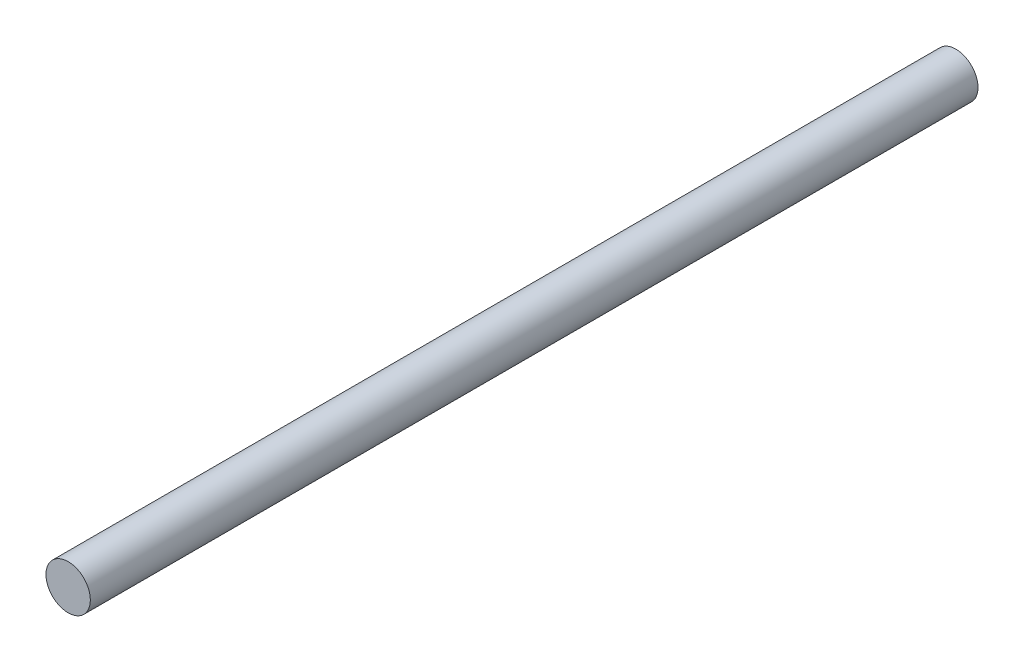
ISO-10303-21;
HEADER;
FILE_DESCRIPTION(('STEP AP214'),'2;1');
FILE_NAME('part.step','',(''),(''),'','','');
FILE_SCHEMA(('AUTOMOTIVE_DESIGN { 1 0 10303 214 1 1 1 1 }'));
ENDSEC;
DATA;
#1=APPLICATION_CONTEXT('core data for automotive mechanical design processes');
#2=APPLICATION_PROTOCOL_DEFINITION('international standard','automotive_design',2000,#1);
#3=PRODUCT_CONTEXT('',#1,'mechanical');
#4=PRODUCT('Part','Part','',(#3));
#5=PRODUCT_RELATED_PRODUCT_CATEGORY('part','',(#4));
#6=PRODUCT_DEFINITION_FORMATION('','',#4);
#7=PRODUCT_DEFINITION_CONTEXT('part definition',#1,'design');
#8=PRODUCT_DEFINITION('design','',#6,#7);
#9=PRODUCT_DEFINITION_SHAPE('','',#8);
#10=(LENGTH_UNIT() NAMED_UNIT(*) SI_UNIT(.MILLI.,.METRE.));
#11=(NAMED_UNIT(*) PLANE_ANGLE_UNIT() SI_UNIT($,.RADIAN.));
#12=(NAMED_UNIT(*) SI_UNIT($,.STERADIAN.) SOLID_ANGLE_UNIT());
#13=UNCERTAINTY_MEASURE_WITH_UNIT(LENGTH_MEASURE(1.E-05),#10,'distance_accuracy_value','');
#14=(GEOMETRIC_REPRESENTATION_CONTEXT(3) GLOBAL_UNCERTAINTY_ASSIGNED_CONTEXT((#13)) GLOBAL_UNIT_ASSIGNED_CONTEXT((#10,
#11,#12)) REPRESENTATION_CONTEXT('',''));
#15=CARTESIAN_POINT('',(0.,0.,0.));
#16=DIRECTION('',(0.,0.,1.));
#17=DIRECTION('',(1.,0.,0.));
#18=AXIS2_PLACEMENT_3D('',#15,#16,#17);
#19=CARTESIAN_POINT('',(0.,0.,100.));
#20=DIRECTION('',(0.,0.,-1.));
#21=DIRECTION('',(-1.,0.,0.));
#22=AXIS2_PLACEMENT_3D('',#19,#20,#21);
#23=CYLINDRICAL_SURFACE('',#22,2.5);
#24=CARTESIAN_POINT('',(0.,-2.5,99.5));
#25=CARTESIAN_POINT('',(0.0277884533963166,-2.49999948790436,99.4999989777508));
#26=CARTESIAN_POINT('',(0.0555898301007615,-2.49953192589115,99.4976755785162));
#27=CARTESIAN_POINT('',(0.11040675384451,-2.49771182811616,99.4884507499424));
#28=CARTESIAN_POINT('',(0.137421658770679,-2.49635858930093,99.4815456835993));
#29=CARTESIAN_POINT('',(0.189865152631659,-2.49291824639143,99.4633793631896));
#30=CARTESIAN_POINT('',(0.215295233966571,-2.49083184538359,99.4521222815777));
#31=CARTESIAN_POINT('',(0.263903994432117,-2.48615199017657,99.4255838762443));
#32=CARTESIAN_POINT('',(0.287082807537908,-2.48355856617853,99.4103027921964));
#33=CARTESIAN_POINT('',(0.330846738657434,-2.47811082664985,99.3759307528543));
#34=CARTESIAN_POINT('',(0.351396975579264,-2.47525372752174,99.3567958223044));
#35=CARTESIAN_POINT('',(0.389018378304016,-2.46962090226294,99.3153537918041));
#36=CARTESIAN_POINT('',(0.406089272385215,-2.46684518250212,99.2930464443324));
#37=CARTESIAN_POINT('',(0.436415876673812,-2.46166220906308,99.2456419034941));
#38=CARTESIAN_POINT('',(0.449635469432935,-2.45925853682473,99.2205211781018));
#39=CARTESIAN_POINT('',(0.471652833290155,-2.45513134029209,99.168359090498));
#40=CARTESIAN_POINT('',(0.480451041218621,-2.45340774880981,99.1413179183268));
#41=CARTESIAN_POINT('',(0.493262649942415,-2.45086402626102,99.0864578180461));
#42=CARTESIAN_POINT('',(0.497337248979388,-2.45003235053594,99.0586537279289));
#43=CARTESIAN_POINT('',(0.500776063863059,-2.44933187530314,99.0027450893178));
#44=CARTESIAN_POINT('',(0.50014076135675,-2.4494629773392,98.9746405718399));
#45=CARTESIAN_POINT('',(0.494227286550911,-2.45066275574092,98.9193766059895));
#46=CARTESIAN_POINT('',(0.489019270121955,-2.45171726429382,98.8922092971864));
#47=CARTESIAN_POINT('',(0.474218942311527,-2.45462273080001,98.8391419616685));
#48=CARTESIAN_POINT('',(0.464626421550339,-2.45647372678889,98.8132419955405));
#49=CARTESIAN_POINT('',(0.441262391837356,-2.46077809250204,98.7632423691482));
#50=CARTESIAN_POINT('',(0.427463075616054,-2.46323544906852,98.7391560602154));
#51=CARTESIAN_POINT('',(0.396096787286338,-2.46847309386531,98.6936145750136));
#52=CARTESIAN_POINT('',(0.378529382178414,-2.47125341919183,98.6721597015744));
#53=CARTESIAN_POINT('',(0.339749967280293,-2.47688510620731,98.6320852987715));
#54=CARTESIAN_POINT('',(0.318478080606224,-2.47973684605452,98.6135237160704));
#55=CARTESIAN_POINT('',(0.273092512031006,-2.48514424357204,98.5802230768494));
#56=CARTESIAN_POINT('',(0.248978793689696,-2.48769989744487,98.5654840693532));
#57=CARTESIAN_POINT('',(0.198529693439462,-2.49223345080444,98.540236245387));
#58=CARTESIAN_POINT('',(0.172190909792652,-2.49421044424136,98.5297340531777));
#59=CARTESIAN_POINT('',(0.118074488224333,-2.49735704493929,98.5133197629807));
#60=CARTESIAN_POINT('',(0.0902970250362237,-2.49852675000266,98.5074071089632));
#61=CARTESIAN_POINT('',(0.0345897028135721,-2.49991335933434,98.5004217731029));
#62=CARTESIAN_POINT('',(0.00667016416278499,-2.50014587326235,98.4992697902299));
#63=CARTESIAN_POINT('',(-0.0489624670963598,-2.49967525965051,98.5016249294711));
#64=CARTESIAN_POINT('',(-0.076675571221899,-2.49897218470723,98.5051317896763));
#65=CARTESIAN_POINT('',(-0.130852829973272,-2.49671916004009,98.516639186772));
#66=CARTESIAN_POINT('',(-0.157325974169952,-2.49517688202103,98.524599034249));
#67=CARTESIAN_POINT('',(-0.208561813749834,-2.49141776030516,98.5447419913279));
#68=CARTESIAN_POINT('',(-0.233324380818771,-2.48920086607113,98.5569254173384));
#69=CARTESIAN_POINT('',(-0.28077058684311,-2.48429955766647,98.5853412453257));
#70=CARTESIAN_POINT('',(-0.303425063376093,-2.48160975218526,98.6016213905195));
#71=CARTESIAN_POINT('',(-0.345709009559602,-2.47607367414941,98.6377045956036));
#72=CARTESIAN_POINT('',(-0.36533815446538,-2.47322738484194,98.6575080331999));
#73=CARTESIAN_POINT('',(-0.401320295387088,-2.46764651778483,98.7004366759456));
#74=CARTESIAN_POINT('',(-0.417618851224327,-2.46491430116652,98.7236078721107));
#75=CARTESIAN_POINT('',(-0.446092710025605,-2.45992095898097,98.7724056806783));
#76=CARTESIAN_POINT('',(-0.458268177961455,-2.45765981456671,98.7980321947868));
#77=CARTESIAN_POINT('',(-0.478075920790984,-2.45388370292191,98.8508841230748));
#78=CARTESIAN_POINT('',(-0.485731749895529,-2.45236487436093,98.8781004206052));
#79=CARTESIAN_POINT('',(-0.496354325813599,-2.45023718396013,98.9334667267455));
#80=CARTESIAN_POINT('',(-0.499321684112557,-2.44962820345556,98.9616166131047));
#81=CARTESIAN_POINT('',(-0.500460455433734,-2.4493957481569,99.0175044322722));
#82=CARTESIAN_POINT('',(-0.498717894035448,-2.4497545959465,99.0452405744635));
#83=CARTESIAN_POINT('',(-0.490676152050031,-2.45137786742307,99.1000158249525));
#84=CARTESIAN_POINT('',(-0.48437700806465,-2.45264228383585,99.1270549388474));
#85=CARTESIAN_POINT('',(-0.46743928424948,-2.45592632109579,99.1796138556203));
#86=CARTESIAN_POINT('',(-0.456811253358677,-2.45794410509415,99.2051371802512));
#87=CARTESIAN_POINT('',(-0.431527322300807,-2.46250857487085,99.2540518603672));
#88=CARTESIAN_POINT('',(-0.416871084387444,-2.46505530499447,99.2774430368626));
#89=CARTESIAN_POINT('',(-0.38365295739321,-2.47044480261613,99.3218577860752));
#90=CARTESIAN_POINT('',(-0.365028943617594,-2.4732918645485,99.3428343826338));
#91=CARTESIAN_POINT('',(-0.324532184506573,-2.47893040935977,99.3813931027646));
#92=CARTESIAN_POINT('',(-0.302658693576667,-2.48172187931592,99.3989744451586));
#93=CARTESIAN_POINT('',(-0.256008814544119,-2.48696916193986,99.4304173219732));
#94=CARTESIAN_POINT('',(-0.231204442214914,-2.48942115609623,99.44423800164));
#95=CARTESIAN_POINT('',(-0.179583180470362,-2.493675625425,99.4674930612983));
#96=CARTESIAN_POINT('',(-0.152768130431558,-2.49547868569308,99.4769313947663));
#97=CARTESIAN_POINT('',(-0.104910744461885,-2.49788186297685,99.4893259740223));
#98=CARTESIAN_POINT('',(-0.0841408320068885,-2.49867151579226,99.4933215968539));
#99=CARTESIAN_POINT('',(-0.0422497626050316,-2.49973077069946,99.4986589561792));
#100=CARTESIAN_POINT('',(-0.0211286168743087,-2.50000038936577,99.5000007772549));
#101=CARTESIAN_POINT('',(0.,-2.5,99.5));
#102=B_SPLINE_CURVE_WITH_KNOTS('',3,(#24,#25,#26,#27,#28,#29,#30,#31,#32,#33,#34,#35,#36,#37,
#38,#39,#40,#41,#42,#43,#44,#45,#46,#47,#48,#49,#50,#51,#52,#53,#54,#55,#56,#57,#58,#59,#60,#61,
#62,#63,#64,#65,#66,#67,#68,#69,#70,#71,#72,#73,#74,#75,#76,#77,#78,#79,#80,#81,#82,#83,#84,#85,
#86,#87,#88,#89,#90,#91,#92,#93,#94,#95,#96,#97,#98,#99,#100,#101),.UNSPECIFIED.,.T.,.F.,(4,2,2,
2,2,2,2,2,2,2,2,2,2,2,2,2,2,2,2,2,2,2,2,2,2,2,2,2,2,2,2,2,2,2,2,2,2,2,4),(0.,0.0832880653306292,
0.166642325345663,0.249916867625174,0.333186451115436,0.417466335056097,0.501752798373686,
0.586805975029624,0.671850746825989,0.75578092551793,0.839702521406114,0.922358635031375,
1.00501869626865,1.08823745101797,1.17146577374836,1.25619126245676,1.3409178376991,
1.42577637427012,1.51062462849018,1.59405367838133,1.67747803828934,1.76015226975362,
1.84283269608011,1.9265253301668,2.01022694172965,2.09520314289613,2.18017594361735,
2.26470190516364,2.34921684165208,2.4321986128385,2.51517971746303,2.59795980626553,
2.68074683790933,2.76494038119571,2.84915327266465,2.93424748337819,3.0192647775876,
3.08259387644947,3.14592095685498),.UNSPECIFIED.);
#103=CARTESIAN_POINT('',(0.,-2.5,99.5));
#104=VERTEX_POINT('',#103);
#105=EDGE_CURVE('E10',#104,#104,#102,.T.);
#106=ORIENTED_EDGE('',*,*,#105,.T.);
#107=EDGE_LOOP('',(#106));
#108=FACE_BOUND('',#107,.T.);
#109=CARTESIAN_POINT('',(0.,-2.5,1.5));
#110=CARTESIAN_POINT('',(0.0277884533963166,-2.49999948790436,1.49999897775083));
#111=CARTESIAN_POINT('',(0.0555898301007612,-2.49953192589115,1.49767557851618));
#112=CARTESIAN_POINT('',(0.11040675384451,-2.49771182811616,1.48845074994238));
#113=CARTESIAN_POINT('',(0.137421658770678,-2.49635858930093,1.48154568359925));
#114=CARTESIAN_POINT('',(0.189865152631656,-2.49291824639143,1.46337936318961));
#115=CARTESIAN_POINT('',(0.215295233966567,-2.49083184538359,1.45212228157766));
#116=CARTESIAN_POINT('',(0.263903994432113,-2.48615199017657,1.42558387624435));
#117=CARTESIAN_POINT('',(0.287082807537906,-2.48355856617854,1.4103027921964));
#118=CARTESIAN_POINT('',(0.330846738657432,-2.47811082664985,1.37593075285428));
#119=CARTESIAN_POINT('',(0.351396975579262,-2.47525372752174,1.3567958223044));
#120=CARTESIAN_POINT('',(0.389018378304014,-2.46962090226294,1.31535379180415));
#121=CARTESIAN_POINT('',(0.406089272385212,-2.46684518250212,1.29304644433244));
#122=CARTESIAN_POINT('',(0.43641587667381,-2.46166220906308,1.24564190349406));
#123=CARTESIAN_POINT('',(0.449635469432933,-2.45925853682473,1.22052117810182));
#124=CARTESIAN_POINT('',(0.471652833290154,-2.45513134029209,1.16835909049796));
#125=CARTESIAN_POINT('',(0.480451041218619,-2.45340774880981,1.14131791832683));
#126=CARTESIAN_POINT('',(0.493262649942413,-2.45086402626102,1.08645781804604));
#127=CARTESIAN_POINT('',(0.497337248979388,-2.45003235053594,1.05865372792889));
#128=CARTESIAN_POINT('',(0.50077606386306,-2.44933187530314,1.00274508931783));
#129=CARTESIAN_POINT('',(0.50014076135675,-2.4494629773392,0.974640571839928));
#130=CARTESIAN_POINT('',(0.494227286550909,-2.45066275574092,0.919376605989499));
#131=CARTESIAN_POINT('',(0.489019270121953,-2.45171726429382,0.892209297186343));
#132=CARTESIAN_POINT('',(0.474218942311525,-2.45462273080001,0.839141961668499));
#133=CARTESIAN_POINT('',(0.46462642155034,-2.45647372678889,0.813241995540496));
#134=CARTESIAN_POINT('',(0.44126239183736,-2.46077809250204,0.763242369148201));
#135=CARTESIAN_POINT('',(0.427463075616057,-2.46323544906852,0.739156060215414));
#136=CARTESIAN_POINT('',(0.39609678728634,-2.46847309386531,0.693614575013593));
#137=CARTESIAN_POINT('',(0.378529382178415,-2.47125341919183,0.672159701574422));
#138=CARTESIAN_POINT('',(0.339749967280292,-2.47688510620731,0.632085298771532));
#139=CARTESIAN_POINT('',(0.318478080606223,-2.47973684605452,0.613523716070435));
#140=CARTESIAN_POINT('',(0.273092512031005,-2.48514424357204,0.580223076849388));
#141=CARTESIAN_POINT('',(0.248978793689695,-2.48769989744487,0.565484069353211));
#142=CARTESIAN_POINT('',(0.19852969343946,-2.49223345080444,0.540236245387013));
#143=CARTESIAN_POINT('',(0.17219090979265,-2.49421044424136,0.529734053177732));
#144=CARTESIAN_POINT('',(0.118074488224332,-2.49735704493929,0.513319762980717));
#145=CARTESIAN_POINT('',(0.0902970250362248,-2.49852675000266,0.507407108963186));
#146=CARTESIAN_POINT('',(0.0345897028135753,-2.49991335933434,0.500421773102861));
#147=CARTESIAN_POINT('',(0.00667016416278819,-2.50014587326235,0.499269790229866));
#148=CARTESIAN_POINT('',(-0.048962467096357,-2.49967525965051,0.50162492947109));
#149=CARTESIAN_POINT('',(-0.0766755712218965,-2.49897218470723,0.505131789676298));
#150=CARTESIAN_POINT('',(-0.13085282997327,-2.49671916004009,0.516639186771978));
#151=CARTESIAN_POINT('',(-0.157325974169951,-2.49517688202103,0.524599034248951));
#152=CARTESIAN_POINT('',(-0.208561813749833,-2.49141776030516,0.544741991327904));
#153=CARTESIAN_POINT('',(-0.23332438081877,-2.48920086607113,0.556925417338415));
#154=CARTESIAN_POINT('',(-0.280770586843109,-2.48429955766647,0.585341245325656));
#155=CARTESIAN_POINT('',(-0.303425063376094,-2.48160975218526,0.601621390519473));
#156=CARTESIAN_POINT('',(-0.345709009559603,-2.47607367414941,0.63770459560364));
#157=CARTESIAN_POINT('',(-0.365338154465381,-2.47322738484194,0.657508033199933));
#158=CARTESIAN_POINT('',(-0.401320295387088,-2.46764651778483,0.700436675945562));
#159=CARTESIAN_POINT('',(-0.417618851224327,-2.46491430116652,0.723607872110669));
#160=CARTESIAN_POINT('',(-0.446092710025603,-2.45992095898097,0.772405680678339));
#161=CARTESIAN_POINT('',(-0.458268177961451,-2.45765981456671,0.798032194786776));
#162=CARTESIAN_POINT('',(-0.47807592079098,-2.45388370292191,0.850884123074774));
#163=CARTESIAN_POINT('',(-0.485731749895525,-2.45236487436093,0.878100420605159));
#164=CARTESIAN_POINT('',(-0.496354325813598,-2.45023718396013,0.933466726745452));
#165=CARTESIAN_POINT('',(-0.499321684112556,-2.44962820345556,0.961616613104674));
#166=CARTESIAN_POINT('',(-0.500460455433734,-2.4493957481569,1.01750443227216));
#167=CARTESIAN_POINT('',(-0.498717894035448,-2.4497545959465,1.0452405744635));
#168=CARTESIAN_POINT('',(-0.49067615205003,-2.45137786742307,1.10001582495251));
#169=CARTESIAN_POINT('',(-0.484377008064649,-2.45264228383585,1.1270549388474));
#170=CARTESIAN_POINT('',(-0.467439284249477,-2.45592632109579,1.17961385562027));
#171=CARTESIAN_POINT('',(-0.456811253358672,-2.45794410509415,1.20513718025121));
#172=CARTESIAN_POINT('',(-0.431527322300802,-2.46250857487085,1.25405186036722));
#173=CARTESIAN_POINT('',(-0.416871084387441,-2.46505530499447,1.27744303686257));
#174=CARTESIAN_POINT('',(-0.383652957393207,-2.47044480261613,1.32185778607516));
#175=CARTESIAN_POINT('',(-0.36502894361759,-2.4732918645485,1.3428343826338));
#176=CARTESIAN_POINT('',(-0.32453218450657,-2.47893040935977,1.38139310276459));
#177=CARTESIAN_POINT('',(-0.302658693576668,-2.48172187931592,1.39897444515864));
#178=CARTESIAN_POINT('',(-0.256008814544123,-2.48696916193986,1.43041732197322));
#179=CARTESIAN_POINT('',(-0.231204442214917,-2.48942115609623,1.44423800164001));
#180=CARTESIAN_POINT('',(-0.179583180470366,-2.493675625425,1.4674930612983));
#181=CARTESIAN_POINT('',(-0.152768130431563,-2.49547868569308,1.47693139476625));
#182=CARTESIAN_POINT('',(-0.10491074446189,-2.49788186297685,1.48932597402236));
#183=CARTESIAN_POINT('',(-0.0841408320068925,-2.49867151579226,1.49332159685388));
#184=CARTESIAN_POINT('',(-0.0422497626050337,-2.49973077069946,1.49865895617918));
#185=CARTESIAN_POINT('',(-0.0211286168743096,-2.50000038936577,1.50000077725488));
#186=CARTESIAN_POINT('',(0.,-2.5,1.5));
#187=B_SPLINE_CURVE_WITH_KNOTS('',3,(#109,#110,#111,#112,#113,#114,#115,#116,#117,#118,#119,
#120,#121,#122,#123,#124,#125,#126,#127,#128,#129,#130,#131,#132,#133,#134,#135,#136,#137,#138,
#139,#140,#141,#142,#143,#144,#145,#146,#147,#148,#149,#150,#151,#152,#153,#154,#155,#156,#157,
#158,#159,#160,#161,#162,#163,#164,#165,#166,#167,#168,#169,#170,#171,#172,#173,#174,#175,#176,
#177,#178,#179,#180,#181,#182,#183,#184,#185,#186),.UNSPECIFIED.,.T.,.F.,(4,2,2,2,2,2,2,2,2,2,2,
2,2,2,2,2,2,2,2,2,2,2,2,2,2,2,2,2,2,2,2,2,2,2,2,2,2,2,4),(0.,0.0832880653306292,
0.166642325345661,0.249916867625171,0.333186451115431,0.417466335056093,0.501752798373682,
0.586805975029613,0.671850746825987,0.755780925517936,0.839702521406125,0.922358635031391,
1.00501869626865,1.08823745101796,1.17146577374835,1.25619126245675,1.3409178376991,
1.42577637427012,1.51062462849018,1.59405367838133,1.67747803828934,1.76015226975362,
1.84283269608011,1.92652533016679,2.01022694172965,2.09520314289613,2.18017594361733,
2.26470190516362,2.34921684165207,2.43219861283851,2.51517971746304,2.59795980626555,
2.68074683790933,2.76494038119571,2.84915327266465,2.93424748337818,3.01926477758759,
3.08259387644947,3.14592095685498),.UNSPECIFIED.);
#188=CARTESIAN_POINT('',(0.,-2.5,1.5));
#189=VERTEX_POINT('',#188);
#190=EDGE_CURVE('E41',#189,#189,#187,.T.);
#191=ORIENTED_EDGE('',*,*,#190,.T.);
#192=EDGE_LOOP('',(#191));
#193=FACE_BOUND('',#192,.T.);
#194=CARTESIAN_POINT('',(0.,0.,100.));
#195=DIRECTION('',(0.,0.,1.));
#196=DIRECTION('',(1.,0.,0.));
#197=AXIS2_PLACEMENT_3D('',#194,#195,#196);
#198=CIRCLE('',#197,2.5);
#199=CARTESIAN_POINT('',(2.5,0.,100.));
#200=VERTEX_POINT('',#199);
#201=EDGE_CURVE('E45',#200,#200,#198,.T.);
#202=ORIENTED_EDGE('',*,*,#201,.F.);
#203=EDGE_LOOP('',(#202));
#204=FACE_BOUND('',#203,.T.);
#205=CARTESIAN_POINT('',(0.,0.,0.));
#206=DIRECTION('',(0.,0.,1.));
#207=DIRECTION('',(1.,0.,0.));
#208=AXIS2_PLACEMENT_3D('',#205,#206,#207);
#209=CIRCLE('',#208,2.5);
#210=CARTESIAN_POINT('',(2.5,0.,0.));
#211=VERTEX_POINT('',#210);
#212=EDGE_CURVE('E49',#211,#211,#209,.T.);
#213=ORIENTED_EDGE('',*,*,#212,.T.);
#214=EDGE_LOOP('',(#213));
#215=FACE_BOUND('',#214,.T.);
#216=ADVANCED_FACE('F31',(#108,#193,#204,#215),#23,.T.);
#217=CARTESIAN_POINT('',(0.,0.,100.));
#218=DIRECTION('',(0.,0.,1.));
#219=DIRECTION('',(1.,0.,0.));
#220=AXIS2_PLACEMENT_3D('',#217,#218,#219);
#221=PLANE('',#220);
#222=ORIENTED_EDGE('',*,*,#201,.T.);
#223=EDGE_LOOP('',(#222));
#224=FACE_BOUND('',#223,.T.);
#225=ADVANCED_FACE('F63',(#224),#221,.T.);
#226=CARTESIAN_POINT('',(0.,0.,0.));
#227=DIRECTION('',(0.,0.,1.));
#228=DIRECTION('',(1.,0.,0.));
#229=AXIS2_PLACEMENT_3D('',#226,#227,#228);
#230=PLANE('',#229);
#231=ORIENTED_EDGE('',*,*,#212,.F.);
#232=EDGE_LOOP('',(#231));
#233=FACE_BOUND('',#232,.T.);
#234=ADVANCED_FACE('F61',(#233),#230,.F.);
#235=CARTESIAN_POINT('',(0.,-2.5,1.));
#236=DIRECTION('',(0.,1.,0.));
#237=DIRECTION('',(0.,0.,1.));
#238=AXIS2_PLACEMENT_3D('',#235,#236,#237);
#239=CYLINDRICAL_SURFACE('',#238,0.5);
#240=CARTESIAN_POINT('',(0.,0.,1.));
#241=DIRECTION('',(0.,1.,0.));
#242=DIRECTION('',(0.,0.,1.));
#243=AXIS2_PLACEMENT_3D('',#240,#241,#242);
#244=CIRCLE('',#243,0.5);
#245=CARTESIAN_POINT('',(0.,0.,1.5));
#246=VERTEX_POINT('',#245);
#247=EDGE_CURVE('E78',#246,#246,#244,.T.);
#248=ORIENTED_EDGE('',*,*,#247,.T.);
#249=EDGE_LOOP('',(#248));
#250=FACE_BOUND('',#249,.T.);
#251=ORIENTED_EDGE('',*,*,#190,.F.);
#252=EDGE_LOOP('',(#251));
#253=FACE_BOUND('',#252,.T.);
#254=ADVANCED_FACE('F55',(#250,#253),#239,.F.);
#255=CARTESIAN_POINT('',(0.,0.,1.));
#256=DIRECTION('',(0.,1.,0.));
#257=DIRECTION('',(0.,0.,1.));
#258=AXIS2_PLACEMENT_3D('',#255,#256,#257);
#259=PLANE('',#258);
#260=ORIENTED_EDGE('',*,*,#247,.F.);
#261=EDGE_LOOP('',(#260));
#262=FACE_BOUND('',#261,.T.);
#263=ADVANCED_FACE('F60',(#262),#259,.F.);
#264=CARTESIAN_POINT('',(0.,-2.5,99.));
#265=DIRECTION('',(0.,1.,0.));
#266=DIRECTION('',(0.,0.,1.));
#267=AXIS2_PLACEMENT_3D('',#264,#265,#266);
#268=CYLINDRICAL_SURFACE('',#267,0.5);
#269=CARTESIAN_POINT('',(0.,0.,99.));
#270=DIRECTION('',(0.,1.,0.));
#271=DIRECTION('',(0.,0.,1.));
#272=AXIS2_PLACEMENT_3D('',#269,#270,#271);
#273=CIRCLE('',#272,0.5);
#274=CARTESIAN_POINT('',(0.,0.,99.5));
#275=VERTEX_POINT('',#274);
#276=EDGE_CURVE('E80',#275,#275,#273,.T.);
#277=ORIENTED_EDGE('',*,*,#276,.T.);
#278=EDGE_LOOP('',(#277));
#279=FACE_BOUND('',#278,.T.);
#280=ORIENTED_EDGE('',*,*,#105,.F.);
#281=EDGE_LOOP('',(#280));
#282=FACE_BOUND('',#281,.T.);
#283=ADVANCED_FACE('F87',(#279,#282),#268,.F.);
#284=CARTESIAN_POINT('',(0.,0.,99.));
#285=DIRECTION('',(0.,1.,0.));
#286=DIRECTION('',(0.,0.,1.));
#287=AXIS2_PLACEMENT_3D('',#284,#285,#286);
#288=PLANE('',#287);
#289=ORIENTED_EDGE('',*,*,#276,.F.);
#290=EDGE_LOOP('',(#289));
#291=FACE_BOUND('',#290,.T.);
#292=ADVANCED_FACE('F90',(#291),#288,.F.);
#293=CLOSED_SHELL('',(#216,#225,#234,#254,#263,#283,#292));
#294=MANIFOLD_SOLID_BREP('B2',#293);
#295=ADVANCED_BREP_SHAPE_REPRESENTATION('',(#18,#294),#14);
#296=SHAPE_DEFINITION_REPRESENTATION(#9,#295);
ENDSEC;
END-ISO-10303-21;
